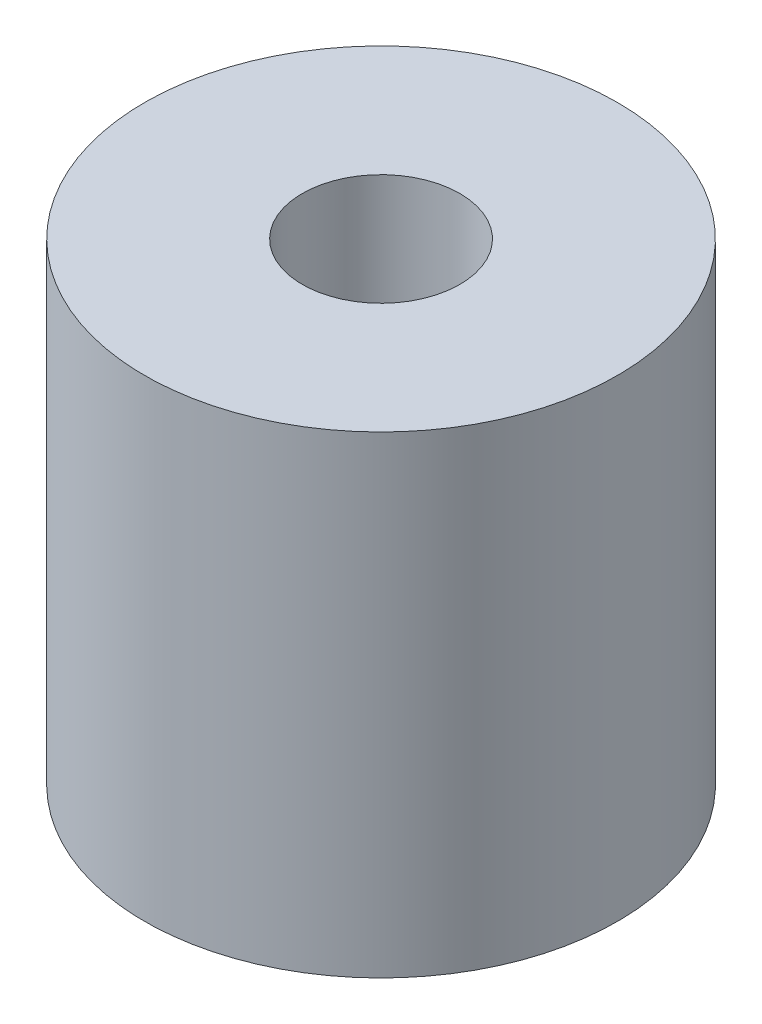
ISO-10303-21;
HEADER;
FILE_DESCRIPTION(('STEP AP214'),'2;1');
FILE_NAME('part.step','',(''),(''),'','','');
FILE_SCHEMA(('AUTOMOTIVE_DESIGN { 1 0 10303 214 1 1 1 1 }'));
ENDSEC;
DATA;
#1=APPLICATION_CONTEXT('core data for automotive mechanical design processes');
#2=APPLICATION_PROTOCOL_DEFINITION('international standard','automotive_design',2000,#1);
#3=PRODUCT_CONTEXT('',#1,'mechanical');
#4=PRODUCT('Part','Part','',(#3));
#5=PRODUCT_RELATED_PRODUCT_CATEGORY('part','',(#4));
#6=PRODUCT_DEFINITION_FORMATION('','',#4);
#7=PRODUCT_DEFINITION_CONTEXT('part definition',#1,'design');
#8=PRODUCT_DEFINITION('design','',#6,#7);
#9=PRODUCT_DEFINITION_SHAPE('','',#8);
#10=(LENGTH_UNIT() NAMED_UNIT(*) SI_UNIT(.MILLI.,.METRE.));
#11=(NAMED_UNIT(*) PLANE_ANGLE_UNIT() SI_UNIT($,.RADIAN.));
#12=(NAMED_UNIT(*) SI_UNIT($,.STERADIAN.) SOLID_ANGLE_UNIT());
#13=UNCERTAINTY_MEASURE_WITH_UNIT(LENGTH_MEASURE(1.E-05),#10,'distance_accuracy_value','');
#14=(GEOMETRIC_REPRESENTATION_CONTEXT(3) GLOBAL_UNCERTAINTY_ASSIGNED_CONTEXT((#13)) GLOBAL_UNIT_ASSIGNED_CONTEXT((#10,
#11,#12)) REPRESENTATION_CONTEXT('',''));
#15=CARTESIAN_POINT('',(0.,0.,0.));
#16=DIRECTION('',(0.,0.,1.));
#17=DIRECTION('',(1.,0.,0.));
#18=AXIS2_PLACEMENT_3D('',#15,#16,#17);
#19=CARTESIAN_POINT('',(0.,-14.7929257269638,0.));
#20=DIRECTION('',(0.,-1.,0.));
#21=DIRECTION('',(0.,0.,-1.));
#22=AXIS2_PLACEMENT_3D('',#19,#20,#21);
#23=CYLINDRICAL_SURFACE('',#22,10.);
#24=CARTESIAN_POINT('',(0.,0.,0.));
#25=DIRECTION('',(0.,-1.,0.));
#26=DIRECTION('',(0.,0.,-1.));
#27=AXIS2_PLACEMENT_3D('',#24,#25,#26);
#28=CIRCLE('',#27,10.);
#29=CARTESIAN_POINT('',(0.,0.,-10.));
#30=VERTEX_POINT('',#29);
#31=EDGE_CURVE('E10',#30,#30,#28,.T.);
#32=ORIENTED_EDGE('',*,*,#31,.T.);
#33=EDGE_LOOP('',(#32));
#34=FACE_BOUND('',#33,.T.);
#35=CARTESIAN_POINT('',(0.,60.,0.));
#36=DIRECTION('',(0.,-1.,0.));
#37=DIRECTION('',(0.,0.,-1.));
#38=AXIS2_PLACEMENT_3D('',#35,#36,#37);
#39=CIRCLE('',#38,10.);
#40=CARTESIAN_POINT('',(0.,60.,-10.));
#41=VERTEX_POINT('',#40);
#42=EDGE_CURVE('E38',#41,#41,#39,.T.);
#43=ORIENTED_EDGE('',*,*,#42,.F.);
#44=EDGE_LOOP('',(#43));
#45=FACE_BOUND('',#44,.T.);
#46=ADVANCED_FACE('F32',(#34,#45),#23,.F.);
#47=CARTESIAN_POINT('',(23.4145695555624,60.,0.));
#48=DIRECTION('',(0.,1.,0.));
#49=DIRECTION('',(0.,0.,1.));
#50=AXIS2_PLACEMENT_3D('',#47,#48,#49);
#51=PLANE('',#50);
#52=ORIENTED_EDGE('',*,*,#42,.T.);
#53=EDGE_LOOP('',(#52));
#54=FACE_BOUND('',#53,.T.);
#55=CARTESIAN_POINT('',(0.,60.,0.));
#56=DIRECTION('',(0.,-1.,0.));
#57=DIRECTION('',(0.,0.,-1.));
#58=AXIS2_PLACEMENT_3D('',#55,#56,#57);
#59=CIRCLE('',#58,30.);
#60=CARTESIAN_POINT('',(0.,60.,-30.));
#61=VERTEX_POINT('',#60);
#62=EDGE_CURVE('E42',#61,#61,#59,.T.);
#63=ORIENTED_EDGE('',*,*,#62,.F.);
#64=EDGE_LOOP('',(#63));
#65=FACE_BOUND('',#64,.T.);
#66=ADVANCED_FACE('F57',(#54,#65),#51,.T.);
#67=CARTESIAN_POINT('',(0.,-14.7929257269638,0.));
#68=DIRECTION('',(0.,-1.,0.));
#69=DIRECTION('',(0.,0.,-1.));
#70=AXIS2_PLACEMENT_3D('',#67,#68,#69);
#71=CYLINDRICAL_SURFACE('',#70,30.);
#72=ORIENTED_EDGE('',*,*,#62,.T.);
#73=EDGE_LOOP('',(#72));
#74=FACE_BOUND('',#73,.T.);
#75=CARTESIAN_POINT('',(0.,0.,0.));
#76=DIRECTION('',(0.,-1.,0.));
#77=DIRECTION('',(0.,0.,-1.));
#78=AXIS2_PLACEMENT_3D('',#75,#76,#77);
#79=CIRCLE('',#78,30.);
#80=CARTESIAN_POINT('',(0.,0.,-30.));
#81=VERTEX_POINT('',#80);
#82=EDGE_CURVE('E46',#81,#81,#79,.T.);
#83=ORIENTED_EDGE('',*,*,#82,.F.);
#84=EDGE_LOOP('',(#83));
#85=FACE_BOUND('',#84,.T.);
#86=ADVANCED_FACE('F55',(#74,#85),#71,.T.);
#87=CARTESIAN_POINT('',(30.,0.,0.));
#88=DIRECTION('',(0.,-1.,0.));
#89=DIRECTION('',(0.,0.,-1.));
#90=AXIS2_PLACEMENT_3D('',#87,#88,#89);
#91=PLANE('',#90);
#92=ORIENTED_EDGE('',*,*,#82,.T.);
#93=EDGE_LOOP('',(#92));
#94=FACE_BOUND('',#93,.T.);
#95=ORIENTED_EDGE('',*,*,#31,.F.);
#96=EDGE_LOOP('',(#95));
#97=FACE_BOUND('',#96,.T.);
#98=ADVANCED_FACE('F52',(#94,#97),#91,.T.);
#99=CLOSED_SHELL('',(#46,#66,#86,#98));
#100=MANIFOLD_SOLID_BREP('B2',#99);
#101=ADVANCED_BREP_SHAPE_REPRESENTATION('',(#18,#100),#14);
#102=SHAPE_DEFINITION_REPRESENTATION(#9,#101);
ENDSEC;
END-ISO-10303-21;
